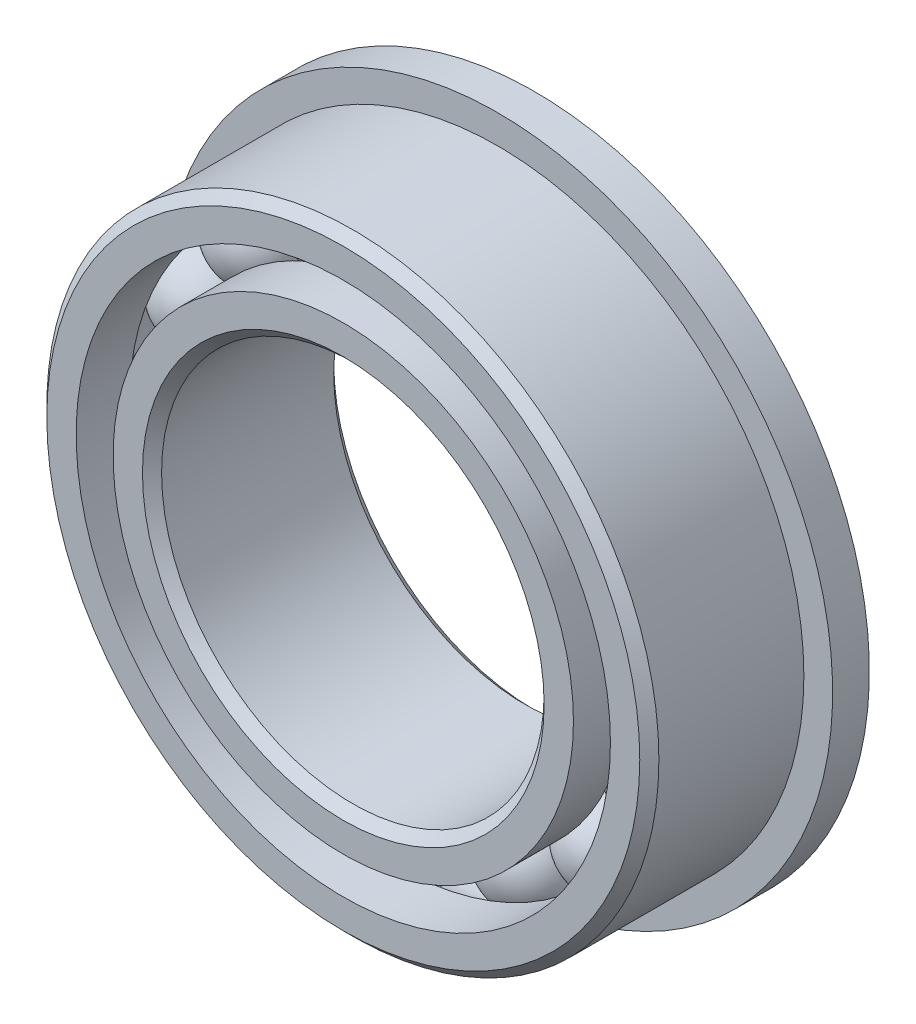
ISO-10303-21;
HEADER;
FILE_DESCRIPTION(('STEP AP214'),'2;1');
FILE_NAME('part.step','',(''),(''),'','','');
FILE_SCHEMA(('AUTOMOTIVE_DESIGN { 1 0 10303 214 1 1 1 1 }'));
ENDSEC;
DATA;
#1=APPLICATION_CONTEXT('core data for automotive mechanical design processes');
#2=APPLICATION_PROTOCOL_DEFINITION('international standard','automotive_design',2000,#1);
#3=PRODUCT_CONTEXT('',#1,'mechanical');
#4=PRODUCT('Part','Part','',(#3));
#5=PRODUCT_RELATED_PRODUCT_CATEGORY('part','',(#4));
#6=PRODUCT_DEFINITION_FORMATION('','',#4);
#7=PRODUCT_DEFINITION_CONTEXT('part definition',#1,'design');
#8=PRODUCT_DEFINITION('design','',#6,#7);
#9=PRODUCT_DEFINITION_SHAPE('','',#8);
#10=(LENGTH_UNIT() NAMED_UNIT(*) SI_UNIT(.MILLI.,.METRE.));
#11=(NAMED_UNIT(*) PLANE_ANGLE_UNIT() SI_UNIT($,.RADIAN.));
#12=(NAMED_UNIT(*) SI_UNIT($,.STERADIAN.) SOLID_ANGLE_UNIT());
#13=UNCERTAINTY_MEASURE_WITH_UNIT(LENGTH_MEASURE(1.E-05),#10,'distance_accuracy_value','');
#14=(GEOMETRIC_REPRESENTATION_CONTEXT(3) GLOBAL_UNCERTAINTY_ASSIGNED_CONTEXT((#13)) GLOBAL_UNIT_ASSIGNED_CONTEXT((#10,
#11,#12)) REPRESENTATION_CONTEXT('',''));
#15=CARTESIAN_POINT('',(0.,0.,0.));
#16=DIRECTION('',(0.,0.,1.));
#17=DIRECTION('',(1.,0.,0.));
#18=AXIS2_PLACEMENT_3D('',#15,#16,#17);
#19=CARTESIAN_POINT('',(-1.97440733385857,4.76664096305045,0.));
#20=DIRECTION('',(0.,0.,1.));
#21=DIRECTION('',(0.382683432365077,-0.923879532511292,0.));
#22=AXIS2_PLACEMENT_3D('',#19,#20,#21);
#23=SPHERICAL_SURFACE('',#22,0.961832467237323);
#24=CARTESIAN_POINT('',(-1.97440733385857,4.76664096305045,0.961832467237323));
#25=VERTEX_POINT('',#24);
#26=VERTEX_LOOP('',#25);
#27=FACE_BOUND('',#26,.T.);
#28=ADVANCED_FACE('F37',(#27),#23,.T.);
#29=CLOSED_SHELL('',(#28));
#30=MANIFOLD_SOLID_BREP('B2',#29);
#31=CARTESIAN_POINT('',(-3.6482290491843,3.64822904918439,0.));
#32=DIRECTION('',(0.,0.,1.));
#33=DIRECTION('',(0.707106781186539,-0.707106781186556,0.));
#34=AXIS2_PLACEMENT_3D('',#31,#32,#33);
#35=SPHERICAL_SURFACE('',#34,0.961832467237323);
#36=CARTESIAN_POINT('',(-3.6482290491843,3.64822904918439,0.961832467237323));
#37=VERTEX_POINT('',#36);
#38=VERTEX_LOOP('',#37);
#39=FACE_BOUND('',#38,.T.);
#40=ADVANCED_FACE('F57',(#39),#35,.T.);
#41=CLOSED_SHELL('',(#40));
#42=MANIFOLD_SOLID_BREP('B6',#41);
#43=CARTESIAN_POINT('',(-4.7666409630504,1.97440733385869,0.));
#44=DIRECTION('',(0.,0.,1.));
#45=DIRECTION('',(0.923879532511283,-0.3826834323651,0.));
#46=AXIS2_PLACEMENT_3D('',#43,#44,#45);
#47=SPHERICAL_SURFACE('',#46,0.961832467237323);
#48=CARTESIAN_POINT('',(-4.7666409630504,1.97440733385869,0.961832467237323));
#49=VERTEX_POINT('',#48);
#50=VERTEX_LOOP('',#49);
#51=FACE_BOUND('',#50,.T.);
#52=ADVANCED_FACE('F77',(#51),#47,.T.);
#53=CLOSED_SHELL('',(#52));
#54=MANIFOLD_SOLID_BREP('B33',#53);
#55=CARTESIAN_POINT('',(-5.159375,0.,0.));
#56=DIRECTION('',(0.,0.,1.));
#57=DIRECTION('',(1.,0.,0.));
#58=AXIS2_PLACEMENT_3D('',#55,#56,#57);
#59=SPHERICAL_SURFACE('',#58,0.961832467237323);
#60=CARTESIAN_POINT('',(-5.159375,0.,0.961832467237323));
#61=VERTEX_POINT('',#60);
#62=VERTEX_LOOP('',#61);
#63=FACE_BOUND('',#62,.T.);
#64=ADVANCED_FACE('F97',(#63),#59,.T.);
#65=CLOSED_SHELL('',(#64));
#66=MANIFOLD_SOLID_BREP('B53',#65);
#67=CARTESIAN_POINT('',(-4.76664096305044,-1.97440733385859,0.));
#68=DIRECTION('',(0.,0.,1.));
#69=DIRECTION('',(0.923879532511291,0.382683432365081,0.));
#70=AXIS2_PLACEMENT_3D('',#67,#68,#69);
#71=SPHERICAL_SURFACE('',#70,0.961832467237323);
#72=CARTESIAN_POINT('',(-4.76664096305044,-1.97440733385859,0.961832467237323));
#73=VERTEX_POINT('',#72);
#74=VERTEX_LOOP('',#73);
#75=FACE_BOUND('',#74,.T.);
#76=ADVANCED_FACE('F117',(#75),#71,.T.);
#77=CLOSED_SHELL('',(#76));
#78=MANIFOLD_SOLID_BREP('B73',#77);
#79=CARTESIAN_POINT('',(-3.64822904918437,-3.64822904918431,0.));
#80=DIRECTION('',(0.,0.,1.));
#81=DIRECTION('',(0.707106781186554,0.707106781186541,0.));
#82=AXIS2_PLACEMENT_3D('',#79,#80,#81);
#83=SPHERICAL_SURFACE('',#82,0.961832467237323);
#84=CARTESIAN_POINT('',(-3.64822904918437,-3.64822904918431,0.961832467237323));
#85=VERTEX_POINT('',#84);
#86=VERTEX_LOOP('',#85);
#87=FACE_BOUND('',#86,.T.);
#88=ADVANCED_FACE('F137',(#87),#83,.T.);
#89=CLOSED_SHELL('',(#88));
#90=MANIFOLD_SOLID_BREP('B93',#89);
#91=CARTESIAN_POINT('',(-1.97440733385867,-4.7666409630504,0.));
#92=DIRECTION('',(0.,0.,1.));
#93=DIRECTION('',(0.382683432365097,0.923879532511284,0.));
#94=AXIS2_PLACEMENT_3D('',#91,#92,#93);
#95=SPHERICAL_SURFACE('',#94,0.961832467237323);
#96=CARTESIAN_POINT('',(-1.97440733385867,-4.7666409630504,0.961832467237323));
#97=VERTEX_POINT('',#96);
#98=VERTEX_LOOP('',#97);
#99=FACE_BOUND('',#98,.T.);
#100=ADVANCED_FACE('F157',(#99),#95,.T.);
#101=CLOSED_SHELL('',(#100));
#102=MANIFOLD_SOLID_BREP('B113',#101);
#103=CARTESIAN_POINT('',(0.,-5.159375,0.));
#104=DIRECTION('',(0.,0.,1.));
#105=DIRECTION('',(0.,1.,0.));
#106=AXIS2_PLACEMENT_3D('',#103,#104,#105);
#107=SPHERICAL_SURFACE('',#106,0.961832467237323);
#108=CARTESIAN_POINT('',(0.,-5.159375,0.961832467237323));
#109=VERTEX_POINT('',#108);
#110=VERTEX_LOOP('',#109);
#111=FACE_BOUND('',#110,.T.);
#112=ADVANCED_FACE('F177',(#111),#107,.T.);
#113=CLOSED_SHELL('',(#112));
#114=MANIFOLD_SOLID_BREP('B133',#113);
#115=CARTESIAN_POINT('',(1.97440733385861,-4.76664096305043,0.));
#116=DIRECTION('',(0.,0.,1.));
#117=DIRECTION('',(-0.382683432365084,0.923879532511289,0.));
#118=AXIS2_PLACEMENT_3D('',#115,#116,#117);
#119=SPHERICAL_SURFACE('',#118,0.961832467237323);
#120=CARTESIAN_POINT('',(1.97440733385861,-4.76664096305043,0.961832467237323));
#121=VERTEX_POINT('',#120);
#122=VERTEX_LOOP('',#121);
#123=FACE_BOUND('',#122,.T.);
#124=ADVANCED_FACE('F197',(#123),#119,.T.);
#125=CLOSED_SHELL('',(#124));
#126=MANIFOLD_SOLID_BREP('B153',#125);
#127=CARTESIAN_POINT('',(3.64822904918432,-3.64822904918436,0.));
#128=DIRECTION('',(0.,0.,1.));
#129=DIRECTION('',(-0.707106781186544,0.707106781186551,0.));
#130=AXIS2_PLACEMENT_3D('',#127,#128,#129);
#131=SPHERICAL_SURFACE('',#130,0.961832467237323);
#132=CARTESIAN_POINT('',(3.64822904918432,-3.64822904918436,0.961832467237323));
#133=VERTEX_POINT('',#132);
#134=VERTEX_LOOP('',#133);
#135=FACE_BOUND('',#134,.T.);
#136=ADVANCED_FACE('F217',(#135),#131,.T.);
#137=CLOSED_SHELL('',(#136));
#138=MANIFOLD_SOLID_BREP('B173',#137);
#139=CARTESIAN_POINT('',(4.76664096305041,-1.97440733385866,0.));
#140=DIRECTION('',(0.,0.,1.));
#141=DIRECTION('',(-0.923879532511285,0.382683432365094,0.));
#142=AXIS2_PLACEMENT_3D('',#139,#140,#141);
#143=SPHERICAL_SURFACE('',#142,0.961832467237323);
#144=CARTESIAN_POINT('',(4.76664096305041,-1.97440733385866,0.961832467237323));
#145=VERTEX_POINT('',#144);
#146=VERTEX_LOOP('',#145);
#147=FACE_BOUND('',#146,.T.);
#148=ADVANCED_FACE('F237',(#147),#143,.T.);
#149=CLOSED_SHELL('',(#148));
#150=MANIFOLD_SOLID_BREP('B193',#149);
#151=CARTESIAN_POINT('',(5.159375,0.,0.));
#152=DIRECTION('',(0.,0.,1.));
#153=DIRECTION('',(-1.,0.,0.));
#154=AXIS2_PLACEMENT_3D('',#151,#152,#153);
#155=SPHERICAL_SURFACE('',#154,0.961832467237323);
#156=CARTESIAN_POINT('',(5.159375,0.,0.961832467237323));
#157=VERTEX_POINT('',#156);
#158=VERTEX_LOOP('',#157);
#159=FACE_BOUND('',#158,.T.);
#160=ADVANCED_FACE('F257',(#159),#155,.T.);
#161=CLOSED_SHELL('',(#160));
#162=MANIFOLD_SOLID_BREP('B213',#161);
#163=CARTESIAN_POINT('',(4.76664096305042,1.97440733385862,0.));
#164=DIRECTION('',(0.,0.,1.));
#165=DIRECTION('',(-0.923879532511288,-0.382683432365087,0.));
#166=AXIS2_PLACEMENT_3D('',#163,#164,#165);
#167=SPHERICAL_SURFACE('',#166,0.961832467237323);
#168=CARTESIAN_POINT('',(4.76664096305042,1.97440733385862,0.961832467237323));
#169=VERTEX_POINT('',#168);
#170=VERTEX_LOOP('',#169);
#171=FACE_BOUND('',#170,.T.);
#172=ADVANCED_FACE('F277',(#171),#167,.T.);
#173=CLOSED_SHELL('',(#172));
#174=MANIFOLD_SOLID_BREP('B233',#173);
#175=CARTESIAN_POINT('',(3.64822904918435,3.64822904918434,0.));
#176=DIRECTION('',(0.,0.,1.));
#177=DIRECTION('',(-0.707106781186549,-0.707106781186546,0.));
#178=AXIS2_PLACEMENT_3D('',#175,#176,#177);
#179=SPHERICAL_SURFACE('',#178,0.961832467237323);
#180=CARTESIAN_POINT('',(3.64822904918435,3.64822904918434,0.961832467237323));
#181=VERTEX_POINT('',#180);
#182=VERTEX_LOOP('',#181);
#183=FACE_BOUND('',#182,.T.);
#184=ADVANCED_FACE('F297',(#183),#179,.T.);
#185=CLOSED_SHELL('',(#184));
#186=MANIFOLD_SOLID_BREP('B253',#185);
#187=CARTESIAN_POINT('',(1.97440733385864,4.76664096305042,0.));
#188=DIRECTION('',(0.,0.,1.));
#189=DIRECTION('',(-0.382683432365091,-0.923879532511287,0.));
#190=AXIS2_PLACEMENT_3D('',#187,#188,#189);
#191=SPHERICAL_SURFACE('',#190,0.961832467237323);
#192=CARTESIAN_POINT('',(1.97440733385864,4.76664096305042,0.961832467237323));
#193=VERTEX_POINT('',#192);
#194=VERTEX_LOOP('',#193);
#195=FACE_BOUND('',#194,.T.);
#196=ADVANCED_FACE('F317',(#195),#191,.T.);
#197=CLOSED_SHELL('',(#196));
#198=MANIFOLD_SOLID_BREP('B273',#197);
#199=CARTESIAN_POINT('',(0.,5.159375,0.));
#200=DIRECTION('',(0.,0.,1.));
#201=DIRECTION('',(0.,-1.,0.));
#202=AXIS2_PLACEMENT_3D('',#199,#200,#201);
#203=SPHERICAL_SURFACE('',#202,0.961832467237323);
#204=CARTESIAN_POINT('',(0.,5.159375,0.961832467237323));
#205=VERTEX_POINT('',#204);
#206=VERTEX_LOOP('',#205);
#207=FACE_BOUND('',#206,.T.);
#208=ADVANCED_FACE('F340',(#207),#203,.T.);
#209=CLOSED_SHELL('',(#208));
#210=MANIFOLD_SOLID_BREP('B293',#209);
#211=CARTESIAN_POINT('',(0.,4.77558379120879,1.984375));
#212=DIRECTION('',(0.,0.,-1.));
#213=DIRECTION('',(-1.,0.,0.));
#214=AXIS2_PLACEMENT_3D('',#211,#212,#213);
#215=PLANE('',#214);
#216=CARTESIAN_POINT('',(0.,0.,1.984375));
#217=DIRECTION('',(0.,0.,1.));
#218=DIRECTION('',(1.,0.,0.));
#219=AXIS2_PLACEMENT_3D('',#216,#217,#218);
#220=CIRCLE('',#219,4.1671875);
#221=CARTESIAN_POINT('',(4.1671875,0.,1.984375));
#222=VERTEX_POINT('',#221);
#223=EDGE_CURVE('E388',#222,#222,#220,.T.);
#224=ORIENTED_EDGE('',*,*,#223,.F.);
#225=EDGE_LOOP('',(#224));
#226=FACE_BOUND('',#225,.T.);
#227=CARTESIAN_POINT('',(0.,0.,1.984375));
#228=DIRECTION('',(0.,0.,1.));
#229=DIRECTION('',(1.,0.,0.));
#230=AXIS2_PLACEMENT_3D('',#227,#228,#229);
#231=CIRCLE('',#230,4.77558379120879);
#232=CARTESIAN_POINT('',(4.77558379120879,0.,1.984375));
#233=VERTEX_POINT('',#232);
#234=EDGE_CURVE('E339',#233,#233,#231,.T.);
#235=ORIENTED_EDGE('',*,*,#234,.T.);
#236=EDGE_LOOP('',(#235));
#237=FACE_BOUND('',#236,.T.);
#238=ADVANCED_FACE('F360',(#226,#237),#215,.F.);
#239=CARTESIAN_POINT('',(0.,0.,1.984375));
#240=DIRECTION('',(0.,0.,1.));
#241=DIRECTION('',(1.,0.,0.));
#242=AXIS2_PLACEMENT_3D('',#239,#240,#241);
#243=CYLINDRICAL_SURFACE('',#242,4.77558379120879);
#244=ORIENTED_EDGE('',*,*,#234,.F.);
#245=EDGE_LOOP('',(#244));
#246=FACE_BOUND('',#245,.T.);
#247=CARTESIAN_POINT('',(0.,0.,0.881944444444444));
#248=DIRECTION('',(0.,0.,1.));
#249=DIRECTION('',(1.,0.,0.));
#250=AXIS2_PLACEMENT_3D('',#247,#248,#249);
#251=CIRCLE('',#250,4.77558379120879);
#252=CARTESIAN_POINT('',(4.77558379120879,0.,0.881944444444444));
#253=VERTEX_POINT('',#252);
#254=EDGE_CURVE('E366',#253,#253,#251,.T.);
#255=ORIENTED_EDGE('',*,*,#254,.T.);
#256=EDGE_LOOP('',(#255));
#257=FACE_BOUND('',#256,.T.);
#258=ADVANCED_FACE('F395',(#246,#257),#243,.T.);
#259=CARTESIAN_POINT('',(0.,0.,0.));
#260=DIRECTION('',(0.,0.,1.));
#261=DIRECTION('',(1.,0.,0.));
#262=AXIS2_PLACEMENT_3D('',#259,#260,#261);
#263=TOROIDAL_SURFACE('',#262,5.159375,0.961832467237323);
#264=ORIENTED_EDGE('',*,*,#254,.F.);
#265=EDGE_LOOP('',(#264));
#266=FACE_BOUND('',#265,.T.);
#267=CARTESIAN_POINT('',(0.,0.,-0.881944444444445));
#268=DIRECTION('',(0.,0.,1.));
#269=DIRECTION('',(1.,0.,0.));
#270=AXIS2_PLACEMENT_3D('',#267,#268,#269);
#271=CIRCLE('',#270,4.77558379120879);
#272=CARTESIAN_POINT('',(4.77558379120879,0.,-0.881944444444445));
#273=VERTEX_POINT('',#272);
#274=EDGE_CURVE('E370',#273,#273,#271,.T.);
#275=ORIENTED_EDGE('',*,*,#274,.T.);
#276=EDGE_LOOP('',(#275));
#277=FACE_BOUND('',#276,.T.);
#278=ADVANCED_FACE('F399',(#266,#277),#263,.F.);
#279=CARTESIAN_POINT('',(0.,0.,1.984375));
#280=DIRECTION('',(0.,0.,1.));
#281=DIRECTION('',(1.,0.,0.));
#282=AXIS2_PLACEMENT_3D('',#279,#280,#281);
#283=CYLINDRICAL_SURFACE('',#282,4.77558379120879);
#284=ORIENTED_EDGE('',*,*,#274,.F.);
#285=EDGE_LOOP('',(#284));
#286=FACE_BOUND('',#285,.T.);
#287=CARTESIAN_POINT('',(0.,0.,-1.984375));
#288=DIRECTION('',(0.,0.,1.));
#289=DIRECTION('',(1.,0.,0.));
#290=AXIS2_PLACEMENT_3D('',#287,#288,#289);
#291=CIRCLE('',#290,4.77558379120879);
#292=CARTESIAN_POINT('',(4.77558379120879,0.,-1.984375));
#293=VERTEX_POINT('',#292);
#294=EDGE_CURVE('E374',#293,#293,#291,.T.);
#295=ORIENTED_EDGE('',*,*,#294,.T.);
#296=EDGE_LOOP('',(#295));
#297=FACE_BOUND('',#296,.T.);
#298=ADVANCED_FACE('F404',(#286,#297),#283,.T.);
#299=CARTESIAN_POINT('',(0.,4.1671875,-1.984375));
#300=DIRECTION('',(0.,0.,1.));
#301=DIRECTION('',(1.,0.,0.));
#302=AXIS2_PLACEMENT_3D('',#299,#300,#301);
#303=PLANE('',#302);
#304=ORIENTED_EDGE('',*,*,#294,.F.);
#305=EDGE_LOOP('',(#304));
#306=FACE_BOUND('',#305,.T.);
#307=CARTESIAN_POINT('',(0.,0.,-1.984375));
#308=DIRECTION('',(0.,0.,1.));
#309=DIRECTION('',(1.,0.,0.));
#310=AXIS2_PLACEMENT_3D('',#307,#308,#309);
#311=CIRCLE('',#310,4.1671875);
#312=CARTESIAN_POINT('',(4.1671875,0.,-1.984375));
#313=VERTEX_POINT('',#312);
#314=EDGE_CURVE('E379',#313,#313,#311,.T.);
#315=ORIENTED_EDGE('',*,*,#314,.T.);
#316=EDGE_LOOP('',(#315));
#317=FACE_BOUND('',#316,.T.);
#318=ADVANCED_FACE('F410',(#306,#317),#303,.F.);
#319=CARTESIAN_POINT('',(0.,0.,-1.7859375));
#320=DIRECTION('',(0.,0.,-1.));
#321=DIRECTION('',(-1.,0.,0.));
#322=AXIS2_PLACEMENT_3D('',#319,#320,#321);
#323=CONICAL_SURFACE('',#322,3.96875,0.785398163397446);
#324=ORIENTED_EDGE('',*,*,#314,.F.);
#325=EDGE_LOOP('',(#324));
#326=FACE_BOUND('',#325,.T.);
#327=CARTESIAN_POINT('',(0.,0.,-1.7859375));
#328=DIRECTION('',(0.,0.,1.));
#329=DIRECTION('',(1.,0.,0.));
#330=AXIS2_PLACEMENT_3D('',#327,#328,#329);
#331=CIRCLE('',#330,3.96875);
#332=CARTESIAN_POINT('',(3.96875,0.,-1.7859375));
#333=VERTEX_POINT('',#332);
#334=EDGE_CURVE('E382',#333,#333,#331,.T.);
#335=ORIENTED_EDGE('',*,*,#334,.T.);
#336=EDGE_LOOP('',(#335));
#337=FACE_BOUND('',#336,.T.);
#338=ADVANCED_FACE('F414',(#326,#337),#323,.F.);
#339=CARTESIAN_POINT('',(0.,0.,1.984375));
#340=DIRECTION('',(0.,0.,1.));
#341=DIRECTION('',(1.,0.,0.));
#342=AXIS2_PLACEMENT_3D('',#339,#340,#341);
#343=CYLINDRICAL_SURFACE('',#342,3.96875);
#344=ORIENTED_EDGE('',*,*,#334,.F.);
#345=EDGE_LOOP('',(#344));
#346=FACE_BOUND('',#345,.T.);
#347=CARTESIAN_POINT('',(0.,0.,1.7859375));
#348=DIRECTION('',(0.,0.,1.));
#349=DIRECTION('',(1.,0.,0.));
#350=AXIS2_PLACEMENT_3D('',#347,#348,#349);
#351=CIRCLE('',#350,3.96875);
#352=CARTESIAN_POINT('',(3.96875,0.,1.7859375));
#353=VERTEX_POINT('',#352);
#354=EDGE_CURVE('E385',#353,#353,#351,.T.);
#355=ORIENTED_EDGE('',*,*,#354,.T.);
#356=EDGE_LOOP('',(#355));
#357=FACE_BOUND('',#356,.T.);
#358=ADVANCED_FACE('F418',(#346,#357),#343,.F.);
#359=CARTESIAN_POINT('',(0.,0.,1.984375));
#360=DIRECTION('',(0.,0.,1.));
#361=DIRECTION('',(1.,0.,0.));
#362=AXIS2_PLACEMENT_3D('',#359,#360,#361);
#363=CONICAL_SURFACE('',#362,4.1671875,0.78539816339745);
#364=ORIENTED_EDGE('',*,*,#354,.F.);
#365=EDGE_LOOP('',(#364));
#366=FACE_BOUND('',#365,.T.);
#367=ORIENTED_EDGE('',*,*,#223,.T.);
#368=EDGE_LOOP('',(#367));
#369=FACE_BOUND('',#368,.T.);
#370=ADVANCED_FACE('F392',(#366,#369),#363,.F.);
#371=CLOSED_SHELL('',(#238,#258,#278,#298,#318,#338,#358,#370));
#372=MANIFOLD_SOLID_BREP('B313',#371);
#373=CARTESIAN_POINT('',(0.,0.,1.7859375));
#374=DIRECTION('',(0.,0.,-1.));
#375=DIRECTION('',(-1.,0.,0.));
#376=AXIS2_PLACEMENT_3D('',#373,#374,#375);
#377=CONICAL_SURFACE('',#376,6.35,0.785398163397447);
#378=CARTESIAN_POINT('',(0.,0.,1.984375));
#379=DIRECTION('',(0.,0.,1.));
#380=DIRECTION('',(1.,0.,0.));
#381=AXIS2_PLACEMENT_3D('',#378,#379,#380);
#382=CIRCLE('',#381,6.1515625);
#383=CARTESIAN_POINT('',(6.1515625,0.,1.984375));
#384=VERTEX_POINT('',#383);
#385=EDGE_CURVE('E504',#384,#384,#382,.T.);
#386=ORIENTED_EDGE('',*,*,#385,.F.);
#387=EDGE_LOOP('',(#386));
#388=FACE_BOUND('',#387,.T.);
#389=CARTESIAN_POINT('',(0.,0.,1.7859375));
#390=DIRECTION('',(0.,0.,1.));
#391=DIRECTION('',(1.,0.,0.));
#392=AXIS2_PLACEMENT_3D('',#389,#390,#391);
#393=CIRCLE('',#392,6.35);
#394=CARTESIAN_POINT('',(6.35,0.,1.7859375));
#395=VERTEX_POINT('',#394);
#396=EDGE_CURVE('E359',#395,#395,#393,.T.);
#397=ORIENTED_EDGE('',*,*,#396,.T.);
#398=EDGE_LOOP('',(#397));
#399=FACE_BOUND('',#398,.T.);
#400=ADVANCED_FACE('F482',(#388,#399),#377,.T.);
#401=CARTESIAN_POINT('',(0.,0.,1.984375));
#402=DIRECTION('',(0.,0.,1.));
#403=DIRECTION('',(1.,0.,0.));
#404=AXIS2_PLACEMENT_3D('',#401,#402,#403);
#405=CYLINDRICAL_SURFACE('',#404,6.35);
#406=CARTESIAN_POINT('',(0.,0.,-1.222375));
#407=DIRECTION('',(0.,0.,1.));
#408=DIRECTION('',(1.,0.,0.));
#409=AXIS2_PLACEMENT_3D('',#406,#407,#408);
#410=CIRCLE('',#409,6.35);
#411=CARTESIAN_POINT('',(6.35,0.,-1.222375));
#412=VERTEX_POINT('',#411);
#413=EDGE_CURVE('E485',#412,#412,#410,.T.);
#414=ORIENTED_EDGE('',*,*,#413,.T.);
#415=EDGE_LOOP('',(#414));
#416=FACE_BOUND('',#415,.T.);
#417=ORIENTED_EDGE('',*,*,#396,.F.);
#418=EDGE_LOOP('',(#417));
#419=FACE_BOUND('',#418,.T.);
#420=ADVANCED_FACE('F525',(#416,#419),#405,.T.);
#421=CARTESIAN_POINT('',(0.,6.1515625,-1.984375));
#422=DIRECTION('',(0.,0.,1.));
#423=DIRECTION('',(1.,0.,0.));
#424=AXIS2_PLACEMENT_3D('',#421,#422,#423);
#425=PLANE('',#424);
#426=CARTESIAN_POINT('',(0.,0.,-1.984375));
#427=DIRECTION('',(0.,0.,1.));
#428=DIRECTION('',(1.,0.,0.));
#429=AXIS2_PLACEMENT_3D('',#426,#427,#428);
#430=CIRCLE('',#429,5.54316620879121);
#431=CARTESIAN_POINT('',(5.54316620879121,0.,-1.984375));
#432=VERTEX_POINT('',#431);
#433=EDGE_CURVE('E489',#432,#432,#430,.T.);
#434=ORIENTED_EDGE('',*,*,#433,.T.);
#435=EDGE_LOOP('',(#434));
#436=FACE_BOUND('',#435,.T.);
#437=CARTESIAN_POINT('',(0.,0.,-1.984375));
#438=DIRECTION('',(0.,0.,-1.));
#439=DIRECTION('',(-1.,0.,0.));
#440=AXIS2_PLACEMENT_3D('',#437,#438,#439);
#441=CIRCLE('',#440,6.9469);
#442=CARTESIAN_POINT('',(-6.9469,0.,-1.984375));
#443=VERTEX_POINT('',#442);
#444=EDGE_CURVE('E507',#443,#443,#441,.T.);
#445=ORIENTED_EDGE('',*,*,#444,.T.);
#446=EDGE_LOOP('',(#445));
#447=FACE_BOUND('',#446,.T.);
#448=ADVANCED_FACE('F528',(#436,#447),#425,.F.);
#449=CARTESIAN_POINT('',(0.,0.,1.984375));
#450=DIRECTION('',(0.,0.,1.));
#451=DIRECTION('',(1.,0.,0.));
#452=AXIS2_PLACEMENT_3D('',#449,#450,#451);
#453=CYLINDRICAL_SURFACE('',#452,5.54316620879121);
#454=ORIENTED_EDGE('',*,*,#433,.F.);
#455=EDGE_LOOP('',(#454));
#456=FACE_BOUND('',#455,.T.);
#457=CARTESIAN_POINT('',(0.,0.,-0.881944444444445));
#458=DIRECTION('',(0.,0.,1.));
#459=DIRECTION('',(1.,0.,0.));
#460=AXIS2_PLACEMENT_3D('',#457,#458,#459);
#461=CIRCLE('',#460,5.54316620879121);
#462=CARTESIAN_POINT('',(5.54316620879121,0.,-0.881944444444445));
#463=VERTEX_POINT('',#462);
#464=EDGE_CURVE('E493',#463,#463,#461,.T.);
#465=ORIENTED_EDGE('',*,*,#464,.T.);
#466=EDGE_LOOP('',(#465));
#467=FACE_BOUND('',#466,.T.);
#468=ADVANCED_FACE('F533',(#456,#467),#453,.F.);
#469=CARTESIAN_POINT('',(0.,0.,0.));
#470=DIRECTION('',(0.,0.,1.));
#471=DIRECTION('',(1.,0.,0.));
#472=AXIS2_PLACEMENT_3D('',#469,#470,#471);
#473=TOROIDAL_SURFACE('',#472,5.159375,0.961832467237323);
#474=ORIENTED_EDGE('',*,*,#464,.F.);
#475=EDGE_LOOP('',(#474));
#476=FACE_BOUND('',#475,.T.);
#477=CARTESIAN_POINT('',(0.,0.,0.881944444444444));
#478=DIRECTION('',(0.,0.,1.));
#479=DIRECTION('',(1.,0.,0.));
#480=AXIS2_PLACEMENT_3D('',#477,#478,#479);
#481=CIRCLE('',#480,5.54316620879121);
#482=CARTESIAN_POINT('',(5.54316620879121,0.,0.881944444444444));
#483=VERTEX_POINT('',#482);
#484=EDGE_CURVE('E498',#483,#483,#481,.T.);
#485=ORIENTED_EDGE('',*,*,#484,.T.);
#486=EDGE_LOOP('',(#485));
#487=FACE_BOUND('',#486,.T.);
#488=ADVANCED_FACE('F540',(#476,#487),#473,.F.);
#489=CARTESIAN_POINT('',(0.,0.,1.984375));
#490=DIRECTION('',(0.,0.,1.));
#491=DIRECTION('',(1.,0.,0.));
#492=AXIS2_PLACEMENT_3D('',#489,#490,#491);
#493=CYLINDRICAL_SURFACE('',#492,5.54316620879121);
#494=ORIENTED_EDGE('',*,*,#484,.F.);
#495=EDGE_LOOP('',(#494));
#496=FACE_BOUND('',#495,.T.);
#497=CARTESIAN_POINT('',(0.,0.,1.984375));
#498=DIRECTION('',(0.,0.,1.));
#499=DIRECTION('',(1.,0.,0.));
#500=AXIS2_PLACEMENT_3D('',#497,#498,#499);
#501=CIRCLE('',#500,5.54316620879121);
#502=CARTESIAN_POINT('',(5.54316620879121,0.,1.984375));
#503=VERTEX_POINT('',#502);
#504=EDGE_CURVE('E501',#503,#503,#501,.T.);
#505=ORIENTED_EDGE('',*,*,#504,.T.);
#506=EDGE_LOOP('',(#505));
#507=FACE_BOUND('',#506,.T.);
#508=ADVANCED_FACE('F544',(#496,#507),#493,.F.);
#509=CARTESIAN_POINT('',(0.,6.1515625,1.984375));
#510=DIRECTION('',(0.,0.,-1.));
#511=DIRECTION('',(-1.,0.,0.));
#512=AXIS2_PLACEMENT_3D('',#509,#510,#511);
#513=PLANE('',#512);
#514=ORIENTED_EDGE('',*,*,#504,.F.);
#515=EDGE_LOOP('',(#514));
#516=FACE_BOUND('',#515,.T.);
#517=ORIENTED_EDGE('',*,*,#385,.T.);
#518=EDGE_LOOP('',(#517));
#519=FACE_BOUND('',#518,.T.);
#520=ADVANCED_FACE('F520',(#516,#519),#513,.F.);
#521=CARTESIAN_POINT('',(0.,5.84736435439561,-1.222375));
#522=DIRECTION('',(0.,0.,1.));
#523=DIRECTION('',(1.,0.,0.));
#524=AXIS2_PLACEMENT_3D('',#521,#522,#523);
#525=PLANE('',#524);
#526=CARTESIAN_POINT('',(0.,0.,-1.222375));
#527=DIRECTION('',(0.,0.,-1.));
#528=DIRECTION('',(-1.,0.,0.));
#529=AXIS2_PLACEMENT_3D('',#526,#527,#528);
#530=CIRCLE('',#529,6.9469);
#531=CARTESIAN_POINT('',(-6.9469,0.,-1.222375));
#532=VERTEX_POINT('',#531);
#533=EDGE_CURVE('E510',#532,#532,#530,.T.);
#534=ORIENTED_EDGE('',*,*,#533,.F.);
#535=EDGE_LOOP('',(#534));
#536=FACE_BOUND('',#535,.T.);
#537=ORIENTED_EDGE('',*,*,#413,.F.);
#538=EDGE_LOOP('',(#537));
#539=FACE_BOUND('',#538,.T.);
#540=ADVANCED_FACE('F517',(#536,#539),#525,.T.);
#541=CARTESIAN_POINT('',(0.,0.,-1.984375));
#542=DIRECTION('',(0.,0.,-1.));
#543=DIRECTION('',(-1.,0.,0.));
#544=AXIS2_PLACEMENT_3D('',#541,#542,#543);
#545=CYLINDRICAL_SURFACE('',#544,6.9469);
#546=ORIENTED_EDGE('',*,*,#533,.T.);
#547=EDGE_LOOP('',(#546));
#548=FACE_BOUND('',#547,.T.);
#549=ORIENTED_EDGE('',*,*,#444,.F.);
#550=EDGE_LOOP('',(#549));
#551=FACE_BOUND('',#550,.T.);
#552=ADVANCED_FACE('F514',(#548,#551),#545,.T.);
#553=CLOSED_SHELL('',(#400,#420,#448,#468,#488,#508,#520,#540,#552));
#554=MANIFOLD_SOLID_BREP('B334',#553);
#555=ADVANCED_BREP_SHAPE_REPRESENTATION('',(#18,#30,#42,#54,#66,#78,#90,#102,#114,#126,#138,
#150,#162,#174,#186,#198,#210,#372,#554),#14);
#556=SHAPE_DEFINITION_REPRESENTATION(#9,#555);
ENDSEC;
END-ISO-10303-21;
